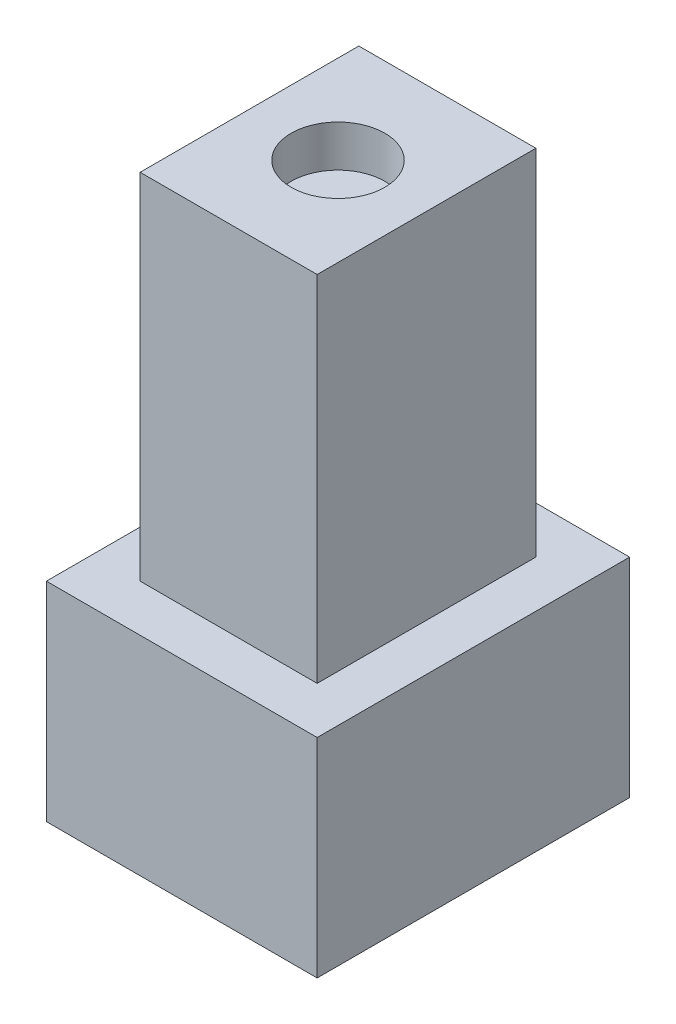
ISO-10303-21;
HEADER;
FILE_DESCRIPTION(('STEP AP214'),'2;1');
FILE_NAME('part.step','',(''),(''),'','','');
FILE_SCHEMA(('AUTOMOTIVE_DESIGN { 1 0 10303 214 1 1 1 1 }'));
ENDSEC;
DATA;
#1=APPLICATION_CONTEXT('core data for automotive mechanical design processes');
#2=APPLICATION_PROTOCOL_DEFINITION('international standard','automotive_design',2000,#1);
#3=PRODUCT_CONTEXT('',#1,'mechanical');
#4=PRODUCT('Part','Part','',(#3));
#5=PRODUCT_RELATED_PRODUCT_CATEGORY('part','',(#4));
#6=PRODUCT_DEFINITION_FORMATION('','',#4);
#7=PRODUCT_DEFINITION_CONTEXT('part definition',#1,'design');
#8=PRODUCT_DEFINITION('design','',#6,#7);
#9=PRODUCT_DEFINITION_SHAPE('','',#8);
#10=(LENGTH_UNIT() NAMED_UNIT(*) SI_UNIT(.MILLI.,.METRE.));
#11=(NAMED_UNIT(*) PLANE_ANGLE_UNIT() SI_UNIT($,.RADIAN.));
#12=(NAMED_UNIT(*) SI_UNIT($,.STERADIAN.) SOLID_ANGLE_UNIT());
#13=UNCERTAINTY_MEASURE_WITH_UNIT(LENGTH_MEASURE(1.E-05),#10,'distance_accuracy_value','');
#14=(GEOMETRIC_REPRESENTATION_CONTEXT(3) GLOBAL_UNCERTAINTY_ASSIGNED_CONTEXT((#13)) GLOBAL_UNIT_ASSIGNED_CONTEXT((#10,
#11,#12)) REPRESENTATION_CONTEXT('',''));
#15=CARTESIAN_POINT('',(0.,0.,0.));
#16=DIRECTION('',(0.,0.,1.));
#17=DIRECTION('',(1.,0.,0.));
#18=AXIS2_PLACEMENT_3D('',#15,#16,#17);
#19=CARTESIAN_POINT('',(0.,10.,0.));
#20=DIRECTION('',(0.,-1.,0.));
#21=DIRECTION('',(0.,0.,-1.));
#22=AXIS2_PLACEMENT_3D('',#19,#20,#21);
#23=PLANE('',#22);
#24=DIRECTION('',(0.,0.,1.));
#25=VECTOR('',#24,1.);
#26=CARTESIAN_POINT('',(0.,10.,0.));
#27=LINE('',#26,#25);
#28=CARTESIAN_POINT('',(0.,10.,-15.));
#29=VERTEX_POINT('',#28);
#30=CARTESIAN_POINT('',(0.,10.,0.));
#31=VERTEX_POINT('',#30);
#32=EDGE_CURVE('E128',#29,#31,#27,.T.);
#33=ORIENTED_EDGE('',*,*,#32,.T.);
#34=DIRECTION('',(1.,0.,0.));
#35=VECTOR('',#34,1.);
#36=CARTESIAN_POINT('',(0.,10.,0.));
#37=LINE('',#36,#35);
#38=CARTESIAN_POINT('',(13.,10.,0.));
#39=VERTEX_POINT('',#38);
#40=EDGE_CURVE('E131',#31,#39,#37,.T.);
#41=ORIENTED_EDGE('',*,*,#40,.T.);
#42=DIRECTION('',(0.,0.,-1.));
#43=VECTOR('',#42,1.);
#44=CARTESIAN_POINT('',(13.,10.,0.));
#45=LINE('',#44,#43);
#46=CARTESIAN_POINT('',(13.,10.,-15.));
#47=VERTEX_POINT('',#46);
#48=EDGE_CURVE('E134',#39,#47,#45,.T.);
#49=ORIENTED_EDGE('',*,*,#48,.T.);
#50=DIRECTION('',(-1.,0.,0.));
#51=VECTOR('',#50,1.);
#52=CARTESIAN_POINT('',(0.,10.,-15.));
#53=LINE('',#52,#51);
#54=EDGE_CURVE('E136',#47,#29,#53,.T.);
#55=ORIENTED_EDGE('',*,*,#54,.T.);
#56=EDGE_LOOP('',(#33,#41,#49,#55));
#57=FACE_BOUND('',#56,.T.);
#58=DIRECTION('',(-1.,0.,0.));
#59=VECTOR('',#58,1.);
#60=CARTESIAN_POINT('',(10.75,10.,-12.75));
#61=LINE('',#60,#59);
#62=CARTESIAN_POINT('',(10.75,10.,-12.75));
#63=VERTEX_POINT('',#62);
#64=CARTESIAN_POINT('',(2.25,10.,-12.75));
#65=VERTEX_POINT('',#64);
#66=EDGE_CURVE('E118',#63,#65,#61,.T.);
#67=ORIENTED_EDGE('',*,*,#66,.F.);
#68=DIRECTION('',(0.,0.,-1.));
#69=VECTOR('',#68,1.);
#70=CARTESIAN_POINT('',(10.75,10.,-2.25));
#71=LINE('',#70,#69);
#72=CARTESIAN_POINT('',(10.75,10.,-2.25));
#73=VERTEX_POINT('',#72);
#74=EDGE_CURVE('E115',#73,#63,#71,.T.);
#75=ORIENTED_EDGE('',*,*,#74,.F.);
#76=DIRECTION('',(1.,0.,0.));
#77=VECTOR('',#76,1.);
#78=CARTESIAN_POINT('',(2.25,10.,-2.25));
#79=LINE('',#78,#77);
#80=CARTESIAN_POINT('',(2.25,10.,-2.25));
#81=VERTEX_POINT('',#80);
#82=EDGE_CURVE('E53',#81,#73,#79,.T.);
#83=ORIENTED_EDGE('',*,*,#82,.F.);
#84=DIRECTION('',(0.,0.,1.));
#85=VECTOR('',#84,1.);
#86=CARTESIAN_POINT('',(2.25,10.,-12.75));
#87=LINE('',#86,#85);
#88=EDGE_CURVE('E48',#65,#81,#87,.T.);
#89=ORIENTED_EDGE('',*,*,#88,.F.);
#90=EDGE_LOOP('',(#67,#75,#83,#89));
#91=FACE_BOUND('',#90,.T.);
#92=ADVANCED_FACE('F33',(#57,#91),#23,.F.);
#93=CARTESIAN_POINT('',(0.,10.,0.));
#94=DIRECTION('',(1.,0.,0.));
#95=DIRECTION('',(0.,0.,-1.));
#96=AXIS2_PLACEMENT_3D('',#93,#94,#95);
#97=PLANE('',#96);
#98=DIRECTION('',(0.,0.,1.));
#99=VECTOR('',#98,1.);
#100=CARTESIAN_POINT('',(0.,0.,0.));
#101=LINE('',#100,#99);
#102=CARTESIAN_POINT('',(0.,0.,-15.));
#103=VERTEX_POINT('',#102);
#104=CARTESIAN_POINT('',(0.,0.,0.));
#105=VERTEX_POINT('',#104);
#106=EDGE_CURVE('E119',#103,#105,#101,.T.);
#107=ORIENTED_EDGE('',*,*,#106,.T.);
#108=DIRECTION('',(0.,-1.,0.));
#109=VECTOR('',#108,1.);
#110=CARTESIAN_POINT('',(0.,10.,0.));
#111=LINE('',#110,#109);
#112=EDGE_CURVE('E11',#31,#105,#111,.T.);
#113=ORIENTED_EDGE('',*,*,#112,.F.);
#114=ORIENTED_EDGE('',*,*,#32,.F.);
#115=DIRECTION('',(0.,-1.,0.));
#116=VECTOR('',#115,1.);
#117=CARTESIAN_POINT('',(0.,10.,-15.));
#118=LINE('',#117,#116);
#119=EDGE_CURVE('E137',#29,#103,#118,.T.);
#120=ORIENTED_EDGE('',*,*,#119,.T.);
#121=EDGE_LOOP('',(#107,#113,#114,#120));
#122=FACE_BOUND('',#121,.T.);
#123=ADVANCED_FACE('F35',(#122),#97,.F.);
#124=CARTESIAN_POINT('',(0.,10.,0.));
#125=DIRECTION('',(0.,0.,-1.));
#126=DIRECTION('',(-1.,0.,0.));
#127=AXIS2_PLACEMENT_3D('',#124,#125,#126);
#128=PLANE('',#127);
#129=DIRECTION('',(1.,0.,0.));
#130=VECTOR('',#129,1.);
#131=CARTESIAN_POINT('',(0.,0.,0.));
#132=LINE('',#131,#130);
#133=CARTESIAN_POINT('',(13.,0.,0.));
#134=VERTEX_POINT('',#133);
#135=EDGE_CURVE('E122',#105,#134,#132,.T.);
#136=ORIENTED_EDGE('',*,*,#135,.T.);
#137=DIRECTION('',(0.,-1.,0.));
#138=VECTOR('',#137,1.);
#139=CARTESIAN_POINT('',(13.,10.,0.));
#140=LINE('',#139,#138);
#141=EDGE_CURVE('E41',#39,#134,#140,.T.);
#142=ORIENTED_EDGE('',*,*,#141,.F.);
#143=ORIENTED_EDGE('',*,*,#40,.F.);
#144=ORIENTED_EDGE('',*,*,#112,.T.);
#145=EDGE_LOOP('',(#136,#142,#143,#144));
#146=FACE_BOUND('',#145,.T.);
#147=ADVANCED_FACE('F167',(#146),#128,.F.);
#148=CARTESIAN_POINT('',(13.,10.,0.));
#149=DIRECTION('',(-1.,0.,0.));
#150=DIRECTION('',(0.,0.,1.));
#151=AXIS2_PLACEMENT_3D('',#148,#149,#150);
#152=PLANE('',#151);
#153=DIRECTION('',(0.,0.,-1.));
#154=VECTOR('',#153,1.);
#155=CARTESIAN_POINT('',(13.,0.,0.));
#156=LINE('',#155,#154);
#157=CARTESIAN_POINT('',(13.,0.,-15.));
#158=VERTEX_POINT('',#157);
#159=EDGE_CURVE('E140',#134,#158,#156,.T.);
#160=ORIENTED_EDGE('',*,*,#159,.T.);
#161=DIRECTION('',(0.,-1.,0.));
#162=VECTOR('',#161,1.);
#163=CARTESIAN_POINT('',(13.,10.,-15.));
#164=LINE('',#163,#162);
#165=EDGE_CURVE('E145',#47,#158,#164,.T.);
#166=ORIENTED_EDGE('',*,*,#165,.F.);
#167=ORIENTED_EDGE('',*,*,#48,.F.);
#168=ORIENTED_EDGE('',*,*,#141,.T.);
#169=EDGE_LOOP('',(#160,#166,#167,#168));
#170=FACE_BOUND('',#169,.T.);
#171=ADVANCED_FACE('F152',(#170),#152,.F.);
#172=CARTESIAN_POINT('',(0.,10.,-15.));
#173=DIRECTION('',(0.,0.,1.));
#174=DIRECTION('',(1.,0.,0.));
#175=AXIS2_PLACEMENT_3D('',#172,#173,#174);
#176=PLANE('',#175);
#177=DIRECTION('',(-1.,0.,0.));
#178=VECTOR('',#177,1.);
#179=CARTESIAN_POINT('',(0.,0.,-15.));
#180=LINE('',#179,#178);
#181=EDGE_CURVE('E132',#158,#103,#180,.T.);
#182=ORIENTED_EDGE('',*,*,#181,.T.);
#183=ORIENTED_EDGE('',*,*,#119,.F.);
#184=ORIENTED_EDGE('',*,*,#54,.F.);
#185=ORIENTED_EDGE('',*,*,#165,.T.);
#186=EDGE_LOOP('',(#182,#183,#184,#185));
#187=FACE_BOUND('',#186,.T.);
#188=ADVANCED_FACE('F161',(#187),#176,.F.);
#189=CARTESIAN_POINT('',(0.,0.,0.));
#190=DIRECTION('',(0.,-1.,0.));
#191=DIRECTION('',(0.,0.,-1.));
#192=AXIS2_PLACEMENT_3D('',#189,#190,#191);
#193=PLANE('',#192);
#194=ORIENTED_EDGE('',*,*,#106,.F.);
#195=ORIENTED_EDGE('',*,*,#181,.F.);
#196=ORIENTED_EDGE('',*,*,#159,.F.);
#197=ORIENTED_EDGE('',*,*,#135,.F.);
#198=EDGE_LOOP('',(#194,#195,#196,#197));
#199=FACE_BOUND('',#198,.T.);
#200=ADVANCED_FACE('F158',(#199),#193,.T.);
#201=CARTESIAN_POINT('',(10.75,27.,-12.75));
#202=DIRECTION('',(0.,0.,1.));
#203=DIRECTION('',(1.,0.,0.));
#204=AXIS2_PLACEMENT_3D('',#201,#202,#203);
#205=PLANE('',#204);
#206=ORIENTED_EDGE('',*,*,#66,.T.);
#207=DIRECTION('',(0.,-1.,0.));
#208=VECTOR('',#207,1.);
#209=CARTESIAN_POINT('',(2.25,27.,-12.75));
#210=LINE('',#209,#208);
#211=CARTESIAN_POINT('',(2.25,27.,-12.75));
#212=VERTEX_POINT('',#211);
#213=EDGE_CURVE('E99',#212,#65,#210,.T.);
#214=ORIENTED_EDGE('',*,*,#213,.F.);
#215=DIRECTION('',(-1.,0.,0.));
#216=VECTOR('',#215,1.);
#217=CARTESIAN_POINT('',(10.75,27.,-12.75));
#218=LINE('',#217,#216);
#219=CARTESIAN_POINT('',(10.75,27.,-12.75));
#220=VERTEX_POINT('',#219);
#221=EDGE_CURVE('E106',#220,#212,#218,.T.);
#222=ORIENTED_EDGE('',*,*,#221,.F.);
#223=DIRECTION('',(0.,-1.,0.));
#224=VECTOR('',#223,1.);
#225=CARTESIAN_POINT('',(10.75,27.,-12.75));
#226=LINE('',#225,#224);
#227=EDGE_CURVE('E289',#220,#63,#226,.T.);
#228=ORIENTED_EDGE('',*,*,#227,.T.);
#229=EDGE_LOOP('',(#206,#214,#222,#228));
#230=FACE_BOUND('',#229,.T.);
#231=ADVANCED_FACE('F117',(#230),#205,.F.);
#232=CARTESIAN_POINT('',(2.25,27.,-12.75));
#233=DIRECTION('',(1.,0.,0.));
#234=DIRECTION('',(0.,0.,-1.));
#235=AXIS2_PLACEMENT_3D('',#232,#233,#234);
#236=PLANE('',#235);
#237=ORIENTED_EDGE('',*,*,#88,.T.);
#238=DIRECTION('',(0.,-1.,0.));
#239=VECTOR('',#238,1.);
#240=CARTESIAN_POINT('',(2.25,27.,-2.25));
#241=LINE('',#240,#239);
#242=CARTESIAN_POINT('',(2.25,27.,-2.25));
#243=VERTEX_POINT('',#242);
#244=EDGE_CURVE('E102',#243,#81,#241,.T.);
#245=ORIENTED_EDGE('',*,*,#244,.F.);
#246=DIRECTION('',(0.,0.,1.));
#247=VECTOR('',#246,1.);
#248=CARTESIAN_POINT('',(2.25,27.,-12.75));
#249=LINE('',#248,#247);
#250=EDGE_CURVE('E95',#212,#243,#249,.T.);
#251=ORIENTED_EDGE('',*,*,#250,.F.);
#252=ORIENTED_EDGE('',*,*,#213,.T.);
#253=EDGE_LOOP('',(#237,#245,#251,#252));
#254=FACE_BOUND('',#253,.T.);
#255=ADVANCED_FACE('F97',(#254),#236,.F.);
#256=CARTESIAN_POINT('',(2.25,27.,-2.25));
#257=DIRECTION('',(0.,0.,-1.));
#258=DIRECTION('',(-1.,0.,0.));
#259=AXIS2_PLACEMENT_3D('',#256,#257,#258);
#260=PLANE('',#259);
#261=ORIENTED_EDGE('',*,*,#82,.T.);
#262=DIRECTION('',(0.,-1.,0.));
#263=VECTOR('',#262,1.);
#264=CARTESIAN_POINT('',(10.75,27.,-2.25));
#265=LINE('',#264,#263);
#266=CARTESIAN_POINT('',(10.75,27.,-2.25));
#267=VERTEX_POINT('',#266);
#268=EDGE_CURVE('E124',#267,#73,#265,.T.);
#269=ORIENTED_EDGE('',*,*,#268,.F.);
#270=DIRECTION('',(1.,0.,0.));
#271=VECTOR('',#270,1.);
#272=CARTESIAN_POINT('',(2.25,27.,-2.25));
#273=LINE('',#272,#271);
#274=EDGE_CURVE('E105',#243,#267,#273,.T.);
#275=ORIENTED_EDGE('',*,*,#274,.F.);
#276=ORIENTED_EDGE('',*,*,#244,.T.);
#277=EDGE_LOOP('',(#261,#269,#275,#276));
#278=FACE_BOUND('',#277,.T.);
#279=ADVANCED_FACE('F203',(#278),#260,.F.);
#280=CARTESIAN_POINT('',(10.75,27.,-2.25));
#281=DIRECTION('',(-1.,0.,0.));
#282=DIRECTION('',(0.,0.,1.));
#283=AXIS2_PLACEMENT_3D('',#280,#281,#282);
#284=PLANE('',#283);
#285=ORIENTED_EDGE('',*,*,#74,.T.);
#286=ORIENTED_EDGE('',*,*,#227,.F.);
#287=DIRECTION('',(0.,0.,-1.));
#288=VECTOR('',#287,1.);
#289=CARTESIAN_POINT('',(10.75,27.,-2.25));
#290=LINE('',#289,#288);
#291=EDGE_CURVE('E111',#267,#220,#290,.T.);
#292=ORIENTED_EDGE('',*,*,#291,.F.);
#293=ORIENTED_EDGE('',*,*,#268,.T.);
#294=EDGE_LOOP('',(#285,#286,#292,#293));
#295=FACE_BOUND('',#294,.T.);
#296=ADVANCED_FACE('F209',(#295),#284,.F.);
#297=CARTESIAN_POINT('',(0.,27.,0.));
#298=DIRECTION('',(0.,1.,0.));
#299=DIRECTION('',(0.,0.,1.));
#300=AXIS2_PLACEMENT_3D('',#297,#298,#299);
#301=PLANE('',#300);
#302=CARTESIAN_POINT('',(6.5,27.,-7.5));
#303=DIRECTION('',(0.,1.,0.));
#304=DIRECTION('',(0.,0.,1.));
#305=AXIS2_PLACEMENT_3D('',#302,#303,#304);
#306=CIRCLE('',#305,2.25);
#307=CARTESIAN_POINT('',(6.5,27.,-5.25));
#308=VERTEX_POINT('',#307);
#309=EDGE_CURVE('E282',#308,#308,#306,.T.);
#310=ORIENTED_EDGE('',*,*,#309,.F.);
#311=EDGE_LOOP('',(#310));
#312=FACE_BOUND('',#311,.T.);
#313=ORIENTED_EDGE('',*,*,#221,.T.);
#314=ORIENTED_EDGE('',*,*,#250,.T.);
#315=ORIENTED_EDGE('',*,*,#274,.T.);
#316=ORIENTED_EDGE('',*,*,#291,.T.);
#317=EDGE_LOOP('',(#313,#314,#315,#316));
#318=FACE_BOUND('',#317,.T.);
#319=ADVANCED_FACE('F109',(#312,#318),#301,.T.);
#320=CARTESIAN_POINT('',(6.5,25.,-7.5));
#321=DIRECTION('',(0.,1.,0.));
#322=DIRECTION('',(0.,0.,1.));
#323=AXIS2_PLACEMENT_3D('',#320,#321,#322);
#324=CYLINDRICAL_SURFACE('',#323,2.25);
#325=CARTESIAN_POINT('',(6.5,25.,-7.5));
#326=DIRECTION('',(0.,1.,0.));
#327=DIRECTION('',(0.,0.,1.));
#328=AXIS2_PLACEMENT_3D('',#325,#326,#327);
#329=CIRCLE('',#328,2.25);
#330=CARTESIAN_POINT('',(6.5,25.,-5.25));
#331=VERTEX_POINT('',#330);
#332=EDGE_CURVE('E281',#331,#331,#329,.T.);
#333=ORIENTED_EDGE('',*,*,#332,.F.);
#334=EDGE_LOOP('',(#333));
#335=FACE_BOUND('',#334,.T.);
#336=ORIENTED_EDGE('',*,*,#309,.T.);
#337=EDGE_LOOP('',(#336));
#338=FACE_BOUND('',#337,.T.);
#339=ADVANCED_FACE('F224',(#335,#338),#324,.F.);
#340=CARTESIAN_POINT('',(6.5,25.,-7.5));
#341=DIRECTION('',(0.,1.,0.));
#342=DIRECTION('',(0.,0.,1.));
#343=AXIS2_PLACEMENT_3D('',#340,#341,#342);
#344=PLANE('',#343);
#345=ORIENTED_EDGE('',*,*,#332,.T.);
#346=EDGE_LOOP('',(#345));
#347=FACE_BOUND('',#346,.T.);
#348=ADVANCED_FACE('F232',(#347),#344,.T.);
#349=CLOSED_SHELL('',(#92,#123,#147,#171,#188,#200,#231,#255,#279,#296,#319,#339,#348));
#350=MANIFOLD_SOLID_BREP('B2',#349);
#351=ADVANCED_BREP_SHAPE_REPRESENTATION('',(#18,#350),#14);
#352=SHAPE_DEFINITION_REPRESENTATION(#9,#351);
ENDSEC;
END-ISO-10303-21;
